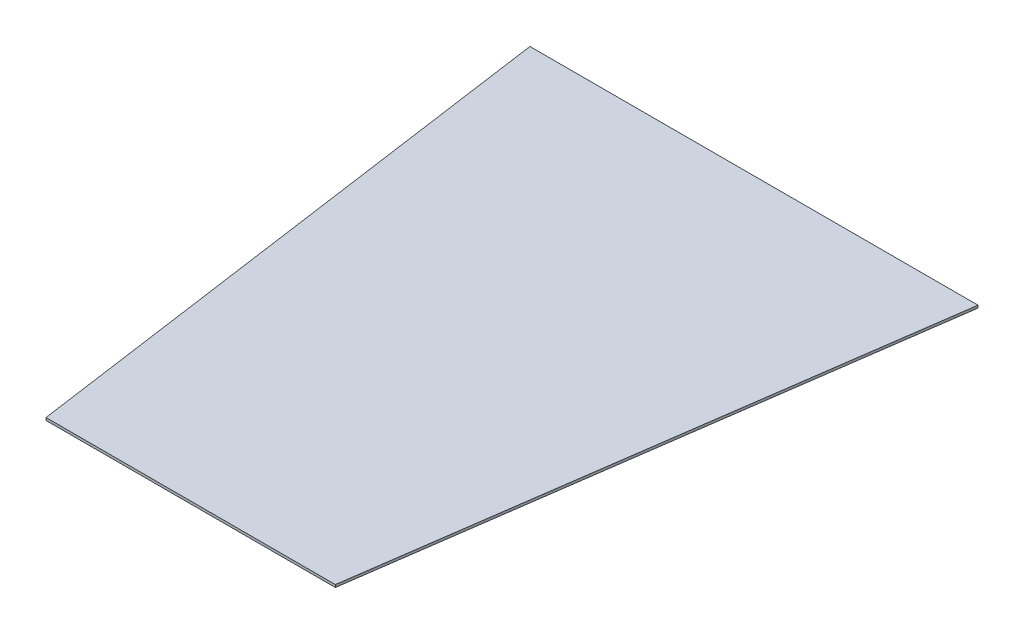
ISO-10303-21;
HEADER;
FILE_DESCRIPTION(('STEP AP214'),'2;1');
FILE_NAME('part.step','',(''),(''),'','','');
FILE_SCHEMA(('AUTOMOTIVE_DESIGN { 1 0 10303 214 1 1 1 1 }'));
ENDSEC;
DATA;
#1=APPLICATION_CONTEXT('core data for automotive mechanical design processes');
#2=APPLICATION_PROTOCOL_DEFINITION('international standard','automotive_design',2000,#1);
#3=PRODUCT_CONTEXT('',#1,'mechanical');
#4=PRODUCT('Part','Part','',(#3));
#5=PRODUCT_RELATED_PRODUCT_CATEGORY('part','',(#4));
#6=PRODUCT_DEFINITION_FORMATION('','',#4);
#7=PRODUCT_DEFINITION_CONTEXT('part definition',#1,'design');
#8=PRODUCT_DEFINITION('design','',#6,#7);
#9=PRODUCT_DEFINITION_SHAPE('','',#8);
#10=(LENGTH_UNIT() NAMED_UNIT(*) SI_UNIT(.MILLI.,.METRE.));
#11=(NAMED_UNIT(*) PLANE_ANGLE_UNIT() SI_UNIT($,.RADIAN.));
#12=(NAMED_UNIT(*) SI_UNIT($,.STERADIAN.) SOLID_ANGLE_UNIT());
#13=UNCERTAINTY_MEASURE_WITH_UNIT(LENGTH_MEASURE(1.E-05),#10,'distance_accuracy_value','');
#14=(GEOMETRIC_REPRESENTATION_CONTEXT(3) GLOBAL_UNCERTAINTY_ASSIGNED_CONTEXT((#13)) GLOBAL_UNIT_ASSIGNED_CONTEXT((#10,
#11,#12)) REPRESENTATION_CONTEXT('',''));
#15=CARTESIAN_POINT('',(0.,0.,0.));
#16=DIRECTION('',(0.,0.,1.));
#17=DIRECTION('',(1.,0.,0.));
#18=AXIS2_PLACEMENT_3D('',#15,#16,#17);
#19=CARTESIAN_POINT('',(-415.943687572023,5.,-350.));
#20=DIRECTION('',(0.,0.,1.));
#21=DIRECTION('',(1.,0.,0.));
#22=AXIS2_PLACEMENT_3D('',#19,#20,#21);
#23=PLANE('',#22);
#24=DIRECTION('',(-1.,0.,0.));
#25=VECTOR('',#24,1.);
#26=CARTESIAN_POINT('',(-415.943687572023,0.,-350.));
#27=LINE('',#26,#25);
#28=CARTESIAN_POINT('',(459.056312427977,0.,-350.));
#29=VERTEX_POINT('',#28);
#30=CARTESIAN_POINT('',(-415.943687572023,0.,-350.));
#31=VERTEX_POINT('',#30);
#32=EDGE_CURVE('E99',#29,#31,#27,.T.);
#33=ORIENTED_EDGE('',*,*,#32,.T.);
#34=DIRECTION('',(0.,-1.,0.));
#35=VECTOR('',#34,1.);
#36=CARTESIAN_POINT('',(-415.943687572023,5.,-350.));
#37=LINE('',#36,#35);
#38=CARTESIAN_POINT('',(-415.943687572023,5.,-350.));
#39=VERTEX_POINT('',#38);
#40=EDGE_CURVE('E11',#39,#31,#37,.T.);
#41=ORIENTED_EDGE('',*,*,#40,.F.);
#42=DIRECTION('',(-1.,0.,0.));
#43=VECTOR('',#42,1.);
#44=CARTESIAN_POINT('',(-415.943687572023,5.,-350.));
#45=LINE('',#44,#43);
#46=CARTESIAN_POINT('',(459.056312427977,5.,-350.));
#47=VERTEX_POINT('',#46);
#48=EDGE_CURVE('E87',#47,#39,#45,.T.);
#49=ORIENTED_EDGE('',*,*,#48,.F.);
#50=DIRECTION('',(0.,-1.,0.));
#51=VECTOR('',#50,1.);
#52=CARTESIAN_POINT('',(459.056312427977,5.,-350.));
#53=LINE('',#52,#51);
#54=EDGE_CURVE('E95',#47,#29,#53,.T.);
#55=ORIENTED_EDGE('',*,*,#54,.T.);
#56=EDGE_LOOP('',(#33,#41,#49,#55));
#57=FACE_BOUND('',#56,.T.);
#58=ADVANCED_FACE('F36',(#57),#23,.F.);
#59=CARTESIAN_POINT('',(-415.943687572023,5.,-350.));
#60=DIRECTION('',(0.990217748068667,0.,-0.139530682682403));
#61=DIRECTION('',(-0.139530682682403,0.,-0.990217748068667));
#62=AXIS2_PLACEMENT_3D('',#59,#60,#61);
#63=PLANE('',#62);
#64=DIRECTION('',(0.139530682682403,0.,0.990217748068667));
#65=VECTOR('',#64,1.);
#66=CARTESIAN_POINT('',(-415.943687572023,0.,-350.));
#67=LINE('',#66,#65);
#68=CARTESIAN_POINT('',(-260.943687572023,0.,750.));
#69=VERTEX_POINT('',#68);
#70=EDGE_CURVE('E91',#31,#69,#67,.T.);
#71=ORIENTED_EDGE('',*,*,#70,.T.);
#72=DIRECTION('',(0.,-1.,0.));
#73=VECTOR('',#72,1.);
#74=CARTESIAN_POINT('',(-260.943687572023,5.,750.));
#75=LINE('',#74,#73);
#76=CARTESIAN_POINT('',(-260.943687572023,5.,750.));
#77=VERTEX_POINT('',#76);
#78=EDGE_CURVE('E44',#77,#69,#75,.T.);
#79=ORIENTED_EDGE('',*,*,#78,.F.);
#80=DIRECTION('',(0.139530682682403,0.,0.990217748068667));
#81=VECTOR('',#80,1.);
#82=CARTESIAN_POINT('',(-415.943687572023,5.,-350.));
#83=LINE('',#82,#81);
#84=EDGE_CURVE('E82',#39,#77,#83,.T.);
#85=ORIENTED_EDGE('',*,*,#84,.F.);
#86=ORIENTED_EDGE('',*,*,#40,.T.);
#87=EDGE_LOOP('',(#71,#79,#85,#86));
#88=FACE_BOUND('',#87,.T.);
#89=ADVANCED_FACE('F90',(#88),#63,.F.);
#90=CARTESIAN_POINT('',(-260.943687572023,5.,750.));
#91=DIRECTION('',(0.,0.,-1.));
#92=DIRECTION('',(-1.,0.,0.));
#93=AXIS2_PLACEMENT_3D('',#90,#91,#92);
#94=PLANE('',#93);
#95=DIRECTION('',(1.,0.,0.));
#96=VECTOR('',#95,1.);
#97=CARTESIAN_POINT('',(-260.943687572023,0.,750.));
#98=LINE('',#97,#96);
#99=CARTESIAN_POINT('',(304.056312427976,0.,750.));
#100=VERTEX_POINT('',#99);
#101=EDGE_CURVE('E69',#69,#100,#98,.T.);
#102=ORIENTED_EDGE('',*,*,#101,.T.);
#103=DIRECTION('',(0.,-1.,0.));
#104=VECTOR('',#103,1.);
#105=CARTESIAN_POINT('',(304.056312427976,5.,750.));
#106=LINE('',#105,#104);
#107=CARTESIAN_POINT('',(304.056312427976,5.,750.));
#108=VERTEX_POINT('',#107);
#109=EDGE_CURVE('E92',#108,#100,#106,.T.);
#110=ORIENTED_EDGE('',*,*,#109,.F.);
#111=DIRECTION('',(1.,0.,0.));
#112=VECTOR('',#111,1.);
#113=CARTESIAN_POINT('',(-260.943687572023,5.,750.));
#114=LINE('',#113,#112);
#115=EDGE_CURVE('E85',#77,#108,#114,.T.);
#116=ORIENTED_EDGE('',*,*,#115,.F.);
#117=ORIENTED_EDGE('',*,*,#78,.T.);
#118=EDGE_LOOP('',(#102,#110,#116,#117));
#119=FACE_BOUND('',#118,.T.);
#120=ADVANCED_FACE('F93',(#119),#94,.F.);
#121=CARTESIAN_POINT('',(304.056312427976,5.,750.));
#122=DIRECTION('',(-0.990217748068667,0.,-0.139530682682403));
#123=DIRECTION('',(-0.139530682682403,0.,0.990217748068667));
#124=AXIS2_PLACEMENT_3D('',#121,#122,#123);
#125=PLANE('',#124);
#126=DIRECTION('',(0.139530682682403,0.,-0.990217748068667));
#127=VECTOR('',#126,1.);
#128=CARTESIAN_POINT('',(304.056312427976,0.,750.));
#129=LINE('',#128,#127);
#130=EDGE_CURVE('E75',#100,#29,#129,.T.);
#131=ORIENTED_EDGE('',*,*,#130,.T.);
#132=ORIENTED_EDGE('',*,*,#54,.F.);
#133=DIRECTION('',(0.139530682682403,0.,-0.990217748068667));
#134=VECTOR('',#133,1.);
#135=CARTESIAN_POINT('',(304.056312427976,5.,750.));
#136=LINE('',#135,#134);
#137=EDGE_CURVE('E52',#108,#47,#136,.T.);
#138=ORIENTED_EDGE('',*,*,#137,.F.);
#139=ORIENTED_EDGE('',*,*,#109,.T.);
#140=EDGE_LOOP('',(#131,#132,#138,#139));
#141=FACE_BOUND('',#140,.T.);
#142=ADVANCED_FACE('F106',(#141),#125,.F.);
#143=CARTESIAN_POINT('',(0.,5.,0.));
#144=DIRECTION('',(0.,1.,0.));
#145=DIRECTION('',(0.,0.,1.));
#146=AXIS2_PLACEMENT_3D('',#143,#144,#145);
#147=PLANE('',#146);
#148=ORIENTED_EDGE('',*,*,#48,.T.);
#149=ORIENTED_EDGE('',*,*,#84,.T.);
#150=ORIENTED_EDGE('',*,*,#115,.T.);
#151=ORIENTED_EDGE('',*,*,#137,.T.);
#152=EDGE_LOOP('',(#148,#149,#150,#151));
#153=FACE_BOUND('',#152,.T.);
#154=ADVANCED_FACE('F83',(#153),#147,.T.);
#155=CARTESIAN_POINT('',(0.,0.,0.));
#156=DIRECTION('',(0.,1.,0.));
#157=DIRECTION('',(0.,0.,1.));
#158=AXIS2_PLACEMENT_3D('',#155,#156,#157);
#159=PLANE('',#158);
#160=ORIENTED_EDGE('',*,*,#32,.F.);
#161=ORIENTED_EDGE('',*,*,#130,.F.);
#162=ORIENTED_EDGE('',*,*,#101,.F.);
#163=ORIENTED_EDGE('',*,*,#70,.F.);
#164=EDGE_LOOP('',(#160,#161,#162,#163));
#165=FACE_BOUND('',#164,.T.);
#166=ADVANCED_FACE('F109',(#165),#159,.F.);
#167=CLOSED_SHELL('',(#58,#89,#120,#142,#154,#166));
#168=MANIFOLD_SOLID_BREP('B2',#167);
#169=ADVANCED_BREP_SHAPE_REPRESENTATION('',(#18,#168),#14);
#170=SHAPE_DEFINITION_REPRESENTATION(#9,#169);
ENDSEC;
END-ISO-10303-21;
